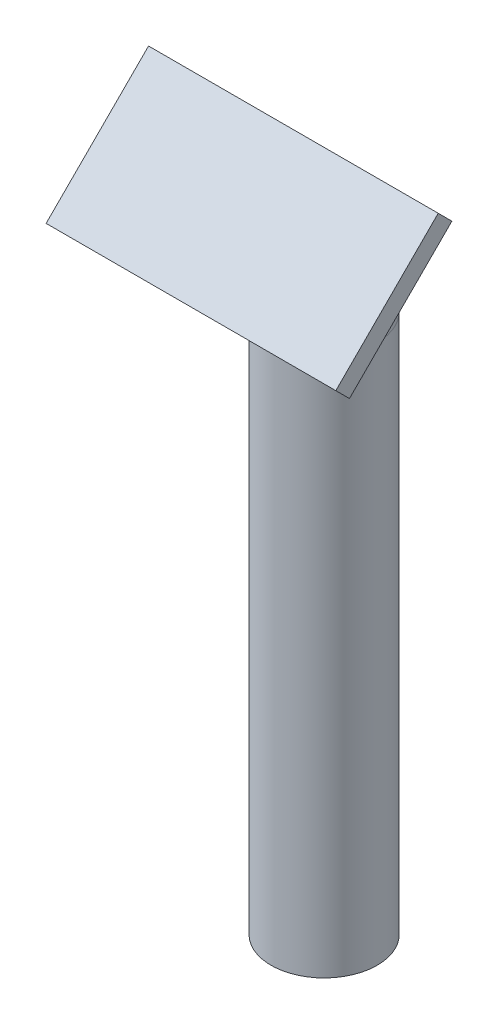
ISO-10303-21;
HEADER;
FILE_DESCRIPTION(('STEP AP214'),'2;1');
FILE_NAME('part.step','',(''),(''),'','','');
FILE_SCHEMA(('AUTOMOTIVE_DESIGN { 1 0 10303 214 1 1 1 1 }'));
ENDSEC;
DATA;
#1=APPLICATION_CONTEXT('core data for automotive mechanical design processes');
#2=APPLICATION_PROTOCOL_DEFINITION('international standard','automotive_design',2000,#1);
#3=PRODUCT_CONTEXT('',#1,'mechanical');
#4=PRODUCT('Part','Part','',(#3));
#5=PRODUCT_RELATED_PRODUCT_CATEGORY('part','',(#4));
#6=PRODUCT_DEFINITION_FORMATION('','',#4);
#7=PRODUCT_DEFINITION_CONTEXT('part definition',#1,'design');
#8=PRODUCT_DEFINITION('design','',#6,#7);
#9=PRODUCT_DEFINITION_SHAPE('','',#8);
#10=(LENGTH_UNIT() NAMED_UNIT(*) SI_UNIT(.MILLI.,.METRE.));
#11=(NAMED_UNIT(*) PLANE_ANGLE_UNIT() SI_UNIT($,.RADIAN.));
#12=(NAMED_UNIT(*) SI_UNIT($,.STERADIAN.) SOLID_ANGLE_UNIT());
#13=UNCERTAINTY_MEASURE_WITH_UNIT(LENGTH_MEASURE(1.E-05),#10,'distance_accuracy_value','');
#14=(GEOMETRIC_REPRESENTATION_CONTEXT(3) GLOBAL_UNCERTAINTY_ASSIGNED_CONTEXT((#13)) GLOBAL_UNIT_ASSIGNED_CONTEXT((#10,
#11,#12)) REPRESENTATION_CONTEXT('',''));
#15=CARTESIAN_POINT('',(0.,0.,0.));
#16=DIRECTION('',(0.,0.,1.));
#17=DIRECTION('',(1.,0.,0.));
#18=AXIS2_PLACEMENT_3D('',#15,#16,#17);
#19=CARTESIAN_POINT('',(0.,-1.11022302462516E-13,-1.11022302462516E-13));
#20=DIRECTION('',(0.,-1.,0.));
#21=DIRECTION('',(0.,0.,-1.));
#22=AXIS2_PLACEMENT_3D('',#19,#20,#21);
#23=PLANE('',#22);
#24=CARTESIAN_POINT('',(0.,-1.11022302462516E-13,-1.11022302462516E-13));
#25=DIRECTION('',(0.,-1.,0.));
#26=DIRECTION('',(0.,0.,-1.));
#27=AXIS2_PLACEMENT_3D('',#24,#25,#26);
#28=CIRCLE('',#27,53.);
#29=CARTESIAN_POINT('',(0.,-3.78752584850872E-13,-53.0000000000001));
#30=VERTEX_POINT('',#29);
#31=EDGE_CURVE('E135',#30,#30,#28,.T.);
#32=ORIENTED_EDGE('',*,*,#31,.F.);
#33=EDGE_LOOP('',(#32));
#34=FACE_BOUND('',#33,.T.);
#35=CARTESIAN_POINT('',(0.,-1.11022302462516E-13,-1.11022302462516E-13));
#36=DIRECTION('',(0.,-1.,0.));
#37=DIRECTION('',(0.,0.,-1.));
#38=AXIS2_PLACEMENT_3D('',#35,#36,#37);
#39=CIRCLE('',#38,55.);
#40=CARTESIAN_POINT('',(0.,-3.88855614374961E-13,-55.0000000000001));
#41=VERTEX_POINT('',#40);
#42=EDGE_CURVE('E148',#41,#41,#39,.T.);
#43=ORIENTED_EDGE('',*,*,#42,.T.);
#44=EDGE_LOOP('',(#43));
#45=FACE_BOUND('',#44,.T.);
#46=ADVANCED_FACE('F56',(#34,#45),#23,.T.);
#47=CARTESIAN_POINT('',(0.,-1.11022302462516E-13,-1.11022302462516E-13));
#48=DIRECTION('',(0.,1.,0.));
#49=DIRECTION('',(0.,0.,1.));
#50=AXIS2_PLACEMENT_3D('',#47,#48,#49);
#51=CYLINDRICAL_SURFACE('',#50,55.);
#52=CARTESIAN_POINT('',(0.,558.57864376269,-1.11022302462516E-13));
#53=DIRECTION('',(0.,-1.,0.));
#54=DIRECTION('',(0.,0.,-1.));
#55=AXIS2_PLACEMENT_3D('',#52,#53,#54);
#56=CIRCLE('',#55,55.);
#57=CARTESIAN_POINT('',(0.,558.578643762689,-55.));
#58=VERTEX_POINT('',#57);
#59=EDGE_CURVE('E64',#58,#58,#56,.T.);
#60=ORIENTED_EDGE('',*,*,#59,.T.);
#61=EDGE_LOOP('',(#60));
#62=FACE_BOUND('',#61,.T.);
#63=ORIENTED_EDGE('',*,*,#42,.F.);
#64=EDGE_LOOP('',(#63));
#65=FACE_BOUND('',#64,.T.);
#66=ADVANCED_FACE('F153',(#62,#65),#51,.T.);
#67=CARTESIAN_POINT('',(0.,558.57864376269,100.));
#68=DIRECTION('',(1.,0.,0.));
#69=DIRECTION('',(0.,0.,-1.));
#70=AXIS2_PLACEMENT_3D('',#67,#68,#69);
#71=TOROIDAL_SURFACE('',#70,100.,55.);
#72=CARTESIAN_POINT('',(0.,629.289321881346,29.2893218813427));
#73=DIRECTION('',(0.,-0.707106781186549,-0.707106781186546));
#74=DIRECTION('',(0.,0.707106781186546,-0.707106781186549));
#75=AXIS2_PLACEMENT_3D('',#72,#73,#74);
#76=CIRCLE('',#75,55.);
#77=CARTESIAN_POINT('',(0.,668.180194846604,-9.60155108391622));
#78=VERTEX_POINT('',#77);
#79=EDGE_CURVE('E13',#78,#78,#76,.T.);
#80=CARTESIAN_POINT('',(0.,558.57864376269,100.));
#81=DIRECTION('',(1.,0.,0.));
#82=DIRECTION('',(0.,0.,-1.));
#83=AXIS2_PLACEMENT_3D('',#80,#81,#82);
#84=CIRCLE('',#83,155.);
#85=EDGE_CURVE('',#58,#78,#84,.T.);
#86=ORIENTED_EDGE('',*,*,#59,.F.);
#87=ORIENTED_EDGE('',*,*,#79,.T.);
#88=ORIENTED_EDGE('',*,*,#85,.T.);
#89=ORIENTED_EDGE('',*,*,#85,.F.);
#90=EDGE_LOOP('',(#86,#88,#87,#89));
#91=FACE_BOUND('',#90,.T.);
#92=ADVANCED_FACE('F156',(#91),#71,.T.);
#93=CARTESIAN_POINT('',(0.,629.289321881346,29.2893218813456));
#94=DIRECTION('',(0.,0.707106781186545,0.70710678118655));
#95=DIRECTION('',(0.,-0.70710678118655,0.707106781186545));
#96=AXIS2_PLACEMENT_3D('',#93,#94,#95);
#97=CYLINDRICAL_SURFACE('',#96,55.);
#98=CARTESIAN_POINT('',(0.,670.710678118655,70.7106781186549));
#99=DIRECTION('',(0.,-0.707106781186549,-0.707106781186546));
#100=DIRECTION('',(0.,0.707106781186546,-0.707106781186549));
#101=AXIS2_PLACEMENT_3D('',#98,#99,#100);
#102=CIRCLE('',#101,55.);
#103=CARTESIAN_POINT('',(0.,709.601551083915,31.8198051533947));
#104=VERTEX_POINT('',#103);
#105=EDGE_CURVE('E132',#104,#104,#102,.T.);
#106=ORIENTED_EDGE('',*,*,#105,.T.);
#107=EDGE_LOOP('',(#106));
#108=FACE_BOUND('',#107,.T.);
#109=ORIENTED_EDGE('',*,*,#79,.F.);
#110=EDGE_LOOP('',(#109));
#111=FACE_BOUND('',#110,.T.);
#112=ADVANCED_FACE('F158',(#108,#111),#97,.T.);
#113=CARTESIAN_POINT('',(0.,-1.11022302462516E-13,-1.11022302462516E-13));
#114=DIRECTION('',(0.,1.,0.));
#115=DIRECTION('',(0.,0.,1.));
#116=AXIS2_PLACEMENT_3D('',#113,#114,#115);
#117=CYLINDRICAL_SURFACE('',#116,53.);
#118=CARTESIAN_POINT('',(0.,558.578643762689,-1.11022302462516E-13));
#119=DIRECTION('',(0.,1.,0.));
#120=DIRECTION('',(0.,0.,1.));
#121=AXIS2_PLACEMENT_3D('',#118,#119,#120);
#122=CIRCLE('',#121,53.);
#123=CARTESIAN_POINT('',(0.,558.578643762689,-53.));
#124=VERTEX_POINT('',#123);
#125=EDGE_CURVE('E136',#124,#124,#122,.F.);
#126=ORIENTED_EDGE('',*,*,#125,.F.);
#127=EDGE_LOOP('',(#126));
#128=FACE_BOUND('',#127,.T.);
#129=ORIENTED_EDGE('',*,*,#31,.T.);
#130=EDGE_LOOP('',(#129));
#131=FACE_BOUND('',#130,.T.);
#132=ADVANCED_FACE('F165',(#128,#131),#117,.F.);
#133=CARTESIAN_POINT('',(0.,558.57864376269,100.));
#134=DIRECTION('',(1.,0.,0.));
#135=DIRECTION('',(0.,0.,-1.));
#136=AXIS2_PLACEMENT_3D('',#133,#134,#135);
#137=TOROIDAL_SURFACE('',#136,100.,53.);
#138=CARTESIAN_POINT('',(0.,629.289321881343,29.2893218813434));
#139=DIRECTION('',(0.,-0.707106781186566,-0.707106781186529));
#140=DIRECTION('',(0.,0.707106781186529,-0.707106781186566));
#141=AXIS2_PLACEMENT_3D('',#138,#139,#140);
#142=CIRCLE('',#141,53.);
#143=CARTESIAN_POINT('',(0.,666.765981284229,-8.18733752154452));
#144=VERTEX_POINT('',#143);
#145=EDGE_CURVE('E139',#144,#144,#142,.T.);
#146=CARTESIAN_POINT('',(0.,558.57864376269,100.));
#147=DIRECTION('',(1.,0.,0.));
#148=DIRECTION('',(0.,0.,-1.));
#149=AXIS2_PLACEMENT_3D('',#146,#147,#148);
#150=CIRCLE('',#149,153.);
#151=EDGE_CURVE('',#124,#144,#150,.T.);
#152=ORIENTED_EDGE('',*,*,#125,.T.);
#153=ORIENTED_EDGE('',*,*,#145,.F.);
#154=ORIENTED_EDGE('',*,*,#151,.T.);
#155=ORIENTED_EDGE('',*,*,#151,.F.);
#156=EDGE_LOOP('',(#152,#154,#153,#155));
#157=FACE_BOUND('',#156,.T.);
#158=ADVANCED_FACE('F173',(#157),#137,.F.);
#159=CARTESIAN_POINT('',(0.,629.289321881346,29.2893218813456));
#160=DIRECTION('',(0.,0.707106781186545,0.70710678118655));
#161=DIRECTION('',(0.,-0.70710678118655,0.707106781186545));
#162=AXIS2_PLACEMENT_3D('',#159,#160,#161);
#163=CYLINDRICAL_SURFACE('',#162,53.);
#164=CARTESIAN_POINT('',(0.,670.710678118655,70.7106781186548));
#165=DIRECTION('',(0.,-0.707106781186549,-0.707106781186546));
#166=DIRECTION('',(0.,0.707106781186546,-0.707106781186549));
#167=AXIS2_PLACEMENT_3D('',#164,#165,#166);
#168=CIRCLE('',#167,53.);
#169=CARTESIAN_POINT('',(0.,708.187337521541,33.2340187157677));
#170=VERTEX_POINT('',#169);
#171=EDGE_CURVE('E141',#170,#170,#168,.T.);
#172=ORIENTED_EDGE('',*,*,#171,.F.);
#173=EDGE_LOOP('',(#172));
#174=FACE_BOUND('',#173,.T.);
#175=ORIENTED_EDGE('',*,*,#145,.T.);
#176=EDGE_LOOP('',(#175));
#177=FACE_BOUND('',#176,.T.);
#178=ADVANCED_FACE('F169',(#174,#177),#163,.F.);
#179=CARTESIAN_POINT('',(0.,370.710678118656,370.710678118655));
#180=DIRECTION('',(0.,-0.707106781186549,-0.707106781186546));
#181=DIRECTION('',(0.,0.707106781186546,-0.707106781186549));
#182=AXIS2_PLACEMENT_3D('',#179,#180,#181);
#183=PLANE('',#182);
#184=ORIENTED_EDGE('',*,*,#171,.T.);
#185=EDGE_LOOP('',(#184));
#186=FACE_BOUND('',#185,.T.);
#187=ADVANCED_FACE('F172',(#186),#183,.T.);
#188=CARTESIAN_POINT('',(150.,631.819805153395,137.885822331377));
#189=DIRECTION('',(-1.,0.,0.));
#190=DIRECTION('',(0.,0.,1.));
#191=AXIS2_PLACEMENT_3D('',#188,#189,#190);
#192=PLANE('',#191);
#193=DIRECTION('',(0.,0.707106781186546,-0.707106781186549));
#194=VECTOR('',#193,1.);
#195=CARTESIAN_POINT('',(150.,617.677669529664,123.743686707646));
#196=LINE('',#195,#194);
#197=CARTESIAN_POINT('',(150.,617.677669529664,123.743686707646));
#198=VERTEX_POINT('',#197);
#199=CARTESIAN_POINT('',(150.,723.743686707646,17.6776695296634));
#200=VERTEX_POINT('',#199);
#201=EDGE_CURVE('E123',#198,#200,#196,.T.);
#202=ORIENTED_EDGE('',*,*,#201,.T.);
#203=DIRECTION('',(0.,-0.707106781186549,-0.707106781186546));
#204=VECTOR('',#203,1.);
#205=CARTESIAN_POINT('',(150.,737.885822331377,31.8198051533944));
#206=LINE('',#205,#204);
#207=CARTESIAN_POINT('',(150.,737.885822331377,31.8198051533944));
#208=VERTEX_POINT('',#207);
#209=EDGE_CURVE('E114',#208,#200,#206,.T.);
#210=ORIENTED_EDGE('',*,*,#209,.F.);
#211=DIRECTION('',(0.,0.707106781186546,-0.707106781186549));
#212=VECTOR('',#211,1.);
#213=CARTESIAN_POINT('',(150.,631.819805153395,137.885822331377));
#214=LINE('',#213,#212);
#215=CARTESIAN_POINT('',(150.,631.819805153395,137.885822331377));
#216=VERTEX_POINT('',#215);
#217=EDGE_CURVE('E108',#216,#208,#214,.T.);
#218=ORIENTED_EDGE('',*,*,#217,.F.);
#219=DIRECTION('',(0.,-0.707106781186549,-0.707106781186546));
#220=VECTOR('',#219,1.);
#221=CARTESIAN_POINT('',(150.,631.819805153395,137.885822331377));
#222=LINE('',#221,#220);
#223=EDGE_CURVE('E119',#216,#198,#222,.T.);
#224=ORIENTED_EDGE('',*,*,#223,.T.);
#225=EDGE_LOOP('',(#202,#210,#218,#224));
#226=FACE_BOUND('',#225,.T.);
#227=ADVANCED_FACE('F181',(#226),#192,.F.);
#228=CARTESIAN_POINT('',(-150.,737.885822331377,31.8198051533944));
#229=DIRECTION('',(0.,-0.707106781186546,0.707106781186549));
#230=DIRECTION('',(0.,-0.707106781186549,-0.707106781186546));
#231=AXIS2_PLACEMENT_3D('',#228,#229,#230);
#232=PLANE('',#231);
#233=DIRECTION('',(-1.,0.,0.));
#234=VECTOR('',#233,1.);
#235=CARTESIAN_POINT('',(-150.,723.743686707646,17.6776695296634));
#236=LINE('',#235,#234);
#237=CARTESIAN_POINT('',(-150.,723.743686707646,17.6776695296634));
#238=VERTEX_POINT('',#237);
#239=EDGE_CURVE('E113',#200,#238,#236,.T.);
#240=ORIENTED_EDGE('',*,*,#239,.T.);
#241=DIRECTION('',(0.,-0.707106781186549,-0.707106781186546));
#242=VECTOR('',#241,1.);
#243=CARTESIAN_POINT('',(-150.,737.885822331377,31.8198051533944));
#244=LINE('',#243,#242);
#245=CARTESIAN_POINT('',(-150.,737.885822331377,31.8198051533944));
#246=VERTEX_POINT('',#245);
#247=EDGE_CURVE('E111',#246,#238,#244,.T.);
#248=ORIENTED_EDGE('',*,*,#247,.F.);
#249=DIRECTION('',(-1.,0.,0.));
#250=VECTOR('',#249,1.);
#251=CARTESIAN_POINT('',(-150.,737.885822331377,31.8198051533944));
#252=LINE('',#251,#250);
#253=EDGE_CURVE('E103',#208,#246,#252,.T.);
#254=ORIENTED_EDGE('',*,*,#253,.F.);
#255=ORIENTED_EDGE('',*,*,#209,.T.);
#256=EDGE_LOOP('',(#240,#248,#254,#255));
#257=FACE_BOUND('',#256,.T.);
#258=ADVANCED_FACE('F112',(#257),#232,.F.);
#259=CARTESIAN_POINT('',(-150.,631.819805153395,137.885822331377));
#260=DIRECTION('',(1.,0.,0.));
#261=DIRECTION('',(0.,0.,-1.));
#262=AXIS2_PLACEMENT_3D('',#259,#260,#261);
#263=PLANE('',#262);
#264=DIRECTION('',(0.,-0.707106781186546,0.707106781186549));
#265=VECTOR('',#264,1.);
#266=CARTESIAN_POINT('',(-150.,617.677669529664,123.743686707646));
#267=LINE('',#266,#265);
#268=CARTESIAN_POINT('',(-150.,617.677669529664,123.743686707646));
#269=VERTEX_POINT('',#268);
#270=EDGE_CURVE('E89',#238,#269,#267,.T.);
#271=ORIENTED_EDGE('',*,*,#270,.T.);
#272=DIRECTION('',(0.,-0.707106781186549,-0.707106781186546));
#273=VECTOR('',#272,1.);
#274=CARTESIAN_POINT('',(-150.,631.819805153395,137.885822331377));
#275=LINE('',#274,#273);
#276=CARTESIAN_POINT('',(-150.,631.819805153395,137.885822331377));
#277=VERTEX_POINT('',#276);
#278=EDGE_CURVE('E115',#277,#269,#275,.T.);
#279=ORIENTED_EDGE('',*,*,#278,.F.);
#280=DIRECTION('',(0.,-0.707106781186546,0.707106781186549));
#281=VECTOR('',#280,1.);
#282=CARTESIAN_POINT('',(-150.,631.819805153395,137.885822331377));
#283=LINE('',#282,#281);
#284=EDGE_CURVE('E106',#246,#277,#283,.T.);
#285=ORIENTED_EDGE('',*,*,#284,.F.);
#286=ORIENTED_EDGE('',*,*,#247,.T.);
#287=EDGE_LOOP('',(#271,#279,#285,#286));
#288=FACE_BOUND('',#287,.T.);
#289=ADVANCED_FACE('F117',(#288),#263,.F.);
#290=CARTESIAN_POINT('',(-150.,631.819805153395,137.885822331377));
#291=DIRECTION('',(0.,0.707106781186546,-0.707106781186549));
#292=DIRECTION('',(0.,0.707106781186549,0.707106781186546));
#293=AXIS2_PLACEMENT_3D('',#290,#291,#292);
#294=PLANE('',#293);
#295=DIRECTION('',(1.,0.,0.));
#296=VECTOR('',#295,1.);
#297=CARTESIAN_POINT('',(-150.,617.677669529664,123.743686707646));
#298=LINE('',#297,#296);
#299=EDGE_CURVE('E95',#269,#198,#298,.T.);
#300=ORIENTED_EDGE('',*,*,#299,.T.);
#301=ORIENTED_EDGE('',*,*,#223,.F.);
#302=DIRECTION('',(1.,0.,0.));
#303=VECTOR('',#302,1.);
#304=CARTESIAN_POINT('',(-150.,631.819805153395,137.885822331377));
#305=LINE('',#304,#303);
#306=EDGE_CURVE('E72',#277,#216,#305,.T.);
#307=ORIENTED_EDGE('',*,*,#306,.F.);
#308=ORIENTED_EDGE('',*,*,#278,.T.);
#309=EDGE_LOOP('',(#300,#301,#307,#308));
#310=FACE_BOUND('',#309,.T.);
#311=ADVANCED_FACE('F189',(#310),#294,.F.);
#312=CARTESIAN_POINT('',(0.,384.852813742387,384.852813742385));
#313=DIRECTION('',(0.,-0.707106781186549,-0.707106781186546));
#314=DIRECTION('',(0.,0.707106781186546,-0.707106781186549));
#315=AXIS2_PLACEMENT_3D('',#312,#313,#314);
#316=PLANE('',#315);
#317=ORIENTED_EDGE('',*,*,#217,.T.);
#318=ORIENTED_EDGE('',*,*,#253,.T.);
#319=ORIENTED_EDGE('',*,*,#284,.T.);
#320=ORIENTED_EDGE('',*,*,#306,.T.);
#321=EDGE_LOOP('',(#317,#318,#319,#320));
#322=FACE_BOUND('',#321,.T.);
#323=ADVANCED_FACE('F104',(#322),#316,.F.);
#324=ORIENTED_EDGE('',*,*,#105,.F.);
#325=EDGE_LOOP('',(#324));
#326=FACE_BOUND('',#325,.T.);
#327=ORIENTED_EDGE('',*,*,#201,.F.);
#328=ORIENTED_EDGE('',*,*,#299,.F.);
#329=ORIENTED_EDGE('',*,*,#270,.F.);
#330=ORIENTED_EDGE('',*,*,#239,.F.);
#331=EDGE_LOOP('',(#327,#328,#329,#330));
#332=FACE_BOUND('',#331,.T.);
#333=ADVANCED_FACE('F192',(#326,#332),#183,.T.);
#334=CLOSED_SHELL('',(#46,#66,#92,#112,#132,#158,#178,#187,#227,#258,#289,#311,#323,#333));
#335=MANIFOLD_SOLID_BREP('B2',#334);
#336=ADVANCED_BREP_SHAPE_REPRESENTATION('',(#18,#335),#14);
#337=SHAPE_DEFINITION_REPRESENTATION(#9,#336);
ENDSEC;
END-ISO-10303-21;
